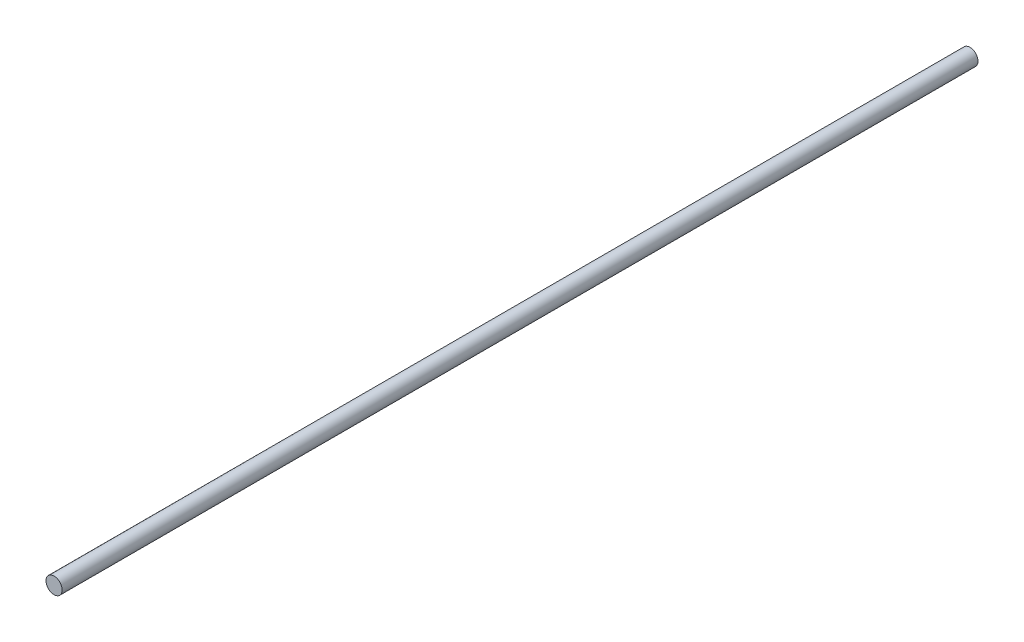
ISO-10303-21;
HEADER;
FILE_DESCRIPTION(('STEP AP214'),'2;1');
FILE_NAME('part.step','',(''),(''),'','','');
FILE_SCHEMA(('AUTOMOTIVE_DESIGN { 1 0 10303 214 1 1 1 1 }'));
ENDSEC;
DATA;
#1=APPLICATION_CONTEXT('core data for automotive mechanical design processes');
#2=APPLICATION_PROTOCOL_DEFINITION('international standard','automotive_design',2000,#1);
#3=PRODUCT_CONTEXT('',#1,'mechanical');
#4=PRODUCT('Part','Part','',(#3));
#5=PRODUCT_RELATED_PRODUCT_CATEGORY('part','',(#4));
#6=PRODUCT_DEFINITION_FORMATION('','',#4);
#7=PRODUCT_DEFINITION_CONTEXT('part definition',#1,'design');
#8=PRODUCT_DEFINITION('design','',#6,#7);
#9=PRODUCT_DEFINITION_SHAPE('','',#8);
#10=(LENGTH_UNIT() NAMED_UNIT(*) SI_UNIT(.MILLI.,.METRE.));
#11=(NAMED_UNIT(*) PLANE_ANGLE_UNIT() SI_UNIT($,.RADIAN.));
#12=(NAMED_UNIT(*) SI_UNIT($,.STERADIAN.) SOLID_ANGLE_UNIT());
#13=UNCERTAINTY_MEASURE_WITH_UNIT(LENGTH_MEASURE(1.E-05),#10,'distance_accuracy_value','');
#14=(GEOMETRIC_REPRESENTATION_CONTEXT(3) GLOBAL_UNCERTAINTY_ASSIGNED_CONTEXT((#13)) GLOBAL_UNIT_ASSIGNED_CONTEXT((#10,
#11,#12)) REPRESENTATION_CONTEXT('',''));
#15=CARTESIAN_POINT('',(0.,0.,0.));
#16=DIRECTION('',(0.,0.,1.));
#17=DIRECTION('',(1.,0.,0.));
#18=AXIS2_PLACEMENT_3D('',#15,#16,#17);
#19=CARTESIAN_POINT('',(0.,0.,85.));
#20=DIRECTION('',(0.,0.,-1.));
#21=DIRECTION('',(-1.,0.,0.));
#22=AXIS2_PLACEMENT_3D('',#19,#20,#21);
#23=CYLINDRICAL_SURFACE('',#22,1.5);
#24=CARTESIAN_POINT('',(0.,0.,85.));
#25=DIRECTION('',(0.,0.,1.));
#26=DIRECTION('',(1.,0.,0.));
#27=AXIS2_PLACEMENT_3D('',#24,#25,#26);
#28=CIRCLE('',#27,1.5);
#29=CARTESIAN_POINT('',(1.5,0.,85.));
#30=VERTEX_POINT('',#29);
#31=EDGE_CURVE('E10',#30,#30,#28,.T.);
#32=ORIENTED_EDGE('',*,*,#31,.F.);
#33=EDGE_LOOP('',(#32));
#34=FACE_BOUND('',#33,.T.);
#35=CARTESIAN_POINT('',(0.,0.,-85.));
#36=DIRECTION('',(0.,0.,1.));
#37=DIRECTION('',(1.,0.,0.));
#38=AXIS2_PLACEMENT_3D('',#35,#36,#37);
#39=CIRCLE('',#38,1.5);
#40=CARTESIAN_POINT('',(1.5,0.,-85.));
#41=VERTEX_POINT('',#40);
#42=EDGE_CURVE('E34',#41,#41,#39,.T.);
#43=ORIENTED_EDGE('',*,*,#42,.T.);
#44=EDGE_LOOP('',(#43));
#45=FACE_BOUND('',#44,.T.);
#46=ADVANCED_FACE('F31',(#34,#45),#23,.T.);
#47=CARTESIAN_POINT('',(0.,0.,85.));
#48=DIRECTION('',(0.,0.,1.));
#49=DIRECTION('',(1.,0.,0.));
#50=AXIS2_PLACEMENT_3D('',#47,#48,#49);
#51=PLANE('',#50);
#52=ORIENTED_EDGE('',*,*,#31,.T.);
#53=EDGE_LOOP('',(#52));
#54=FACE_BOUND('',#53,.T.);
#55=ADVANCED_FACE('F46',(#54),#51,.T.);
#56=CARTESIAN_POINT('',(0.,0.,-85.));
#57=DIRECTION('',(0.,0.,1.));
#58=DIRECTION('',(1.,0.,0.));
#59=AXIS2_PLACEMENT_3D('',#56,#57,#58);
#60=PLANE('',#59);
#61=ORIENTED_EDGE('',*,*,#42,.F.);
#62=EDGE_LOOP('',(#61));
#63=FACE_BOUND('',#62,.T.);
#64=ADVANCED_FACE('F44',(#63),#60,.F.);
#65=CLOSED_SHELL('',(#46,#55,#64));
#66=MANIFOLD_SOLID_BREP('B2',#65);
#67=ADVANCED_BREP_SHAPE_REPRESENTATION('',(#18,#66),#14);
#68=SHAPE_DEFINITION_REPRESENTATION(#9,#67);
ENDSEC;
END-ISO-10303-21;
